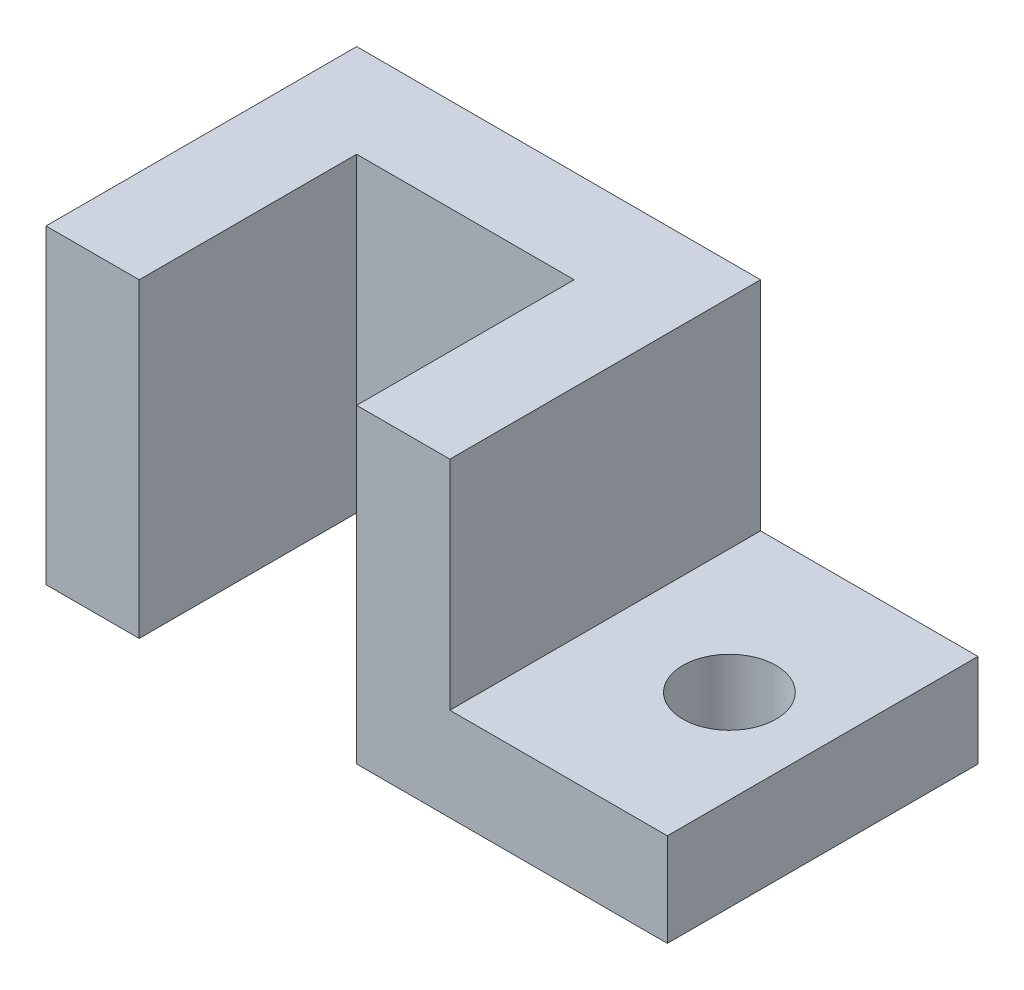
ISO-10303-21;
HEADER;
FILE_DESCRIPTION(('STEP AP214'),'2;1');
FILE_NAME('part.step','',(''),(''),'','','');
FILE_SCHEMA(('AUTOMOTIVE_DESIGN { 1 0 10303 214 1 1 1 1 }'));
ENDSEC;
DATA;
#1=APPLICATION_CONTEXT('core data for automotive mechanical design processes');
#2=APPLICATION_PROTOCOL_DEFINITION('international standard','automotive_design',2000,#1);
#3=PRODUCT_CONTEXT('',#1,'mechanical');
#4=PRODUCT('Part','Part','',(#3));
#5=PRODUCT_RELATED_PRODUCT_CATEGORY('part','',(#4));
#6=PRODUCT_DEFINITION_FORMATION('','',#4);
#7=PRODUCT_DEFINITION_CONTEXT('part definition',#1,'design');
#8=PRODUCT_DEFINITION('design','',#6,#7);
#9=PRODUCT_DEFINITION_SHAPE('','',#8);
#10=(LENGTH_UNIT() NAMED_UNIT(*) SI_UNIT(.MILLI.,.METRE.));
#11=(NAMED_UNIT(*) PLANE_ANGLE_UNIT() SI_UNIT($,.RADIAN.));
#12=(NAMED_UNIT(*) SI_UNIT($,.STERADIAN.) SOLID_ANGLE_UNIT());
#13=UNCERTAINTY_MEASURE_WITH_UNIT(LENGTH_MEASURE(1.E-05),#10,'distance_accuracy_value','');
#14=(GEOMETRIC_REPRESENTATION_CONTEXT(3) GLOBAL_UNCERTAINTY_ASSIGNED_CONTEXT((#13)) GLOBAL_UNIT_ASSIGNED_CONTEXT((#10,
#11,#12)) REPRESENTATION_CONTEXT('',''));
#15=CARTESIAN_POINT('',(0.,0.,0.));
#16=DIRECTION('',(0.,0.,1.));
#17=DIRECTION('',(1.,0.,0.));
#18=AXIS2_PLACEMENT_3D('',#15,#16,#17);
#19=CARTESIAN_POINT('',(0.,63.5,63.5));
#20=DIRECTION('',(1.,0.,0.));
#21=DIRECTION('',(0.,1.,0.));
#22=AXIS2_PLACEMENT_3D('',#19,#20,#21);
#23=PLANE('',#22);
#24=DIRECTION('',(0.,1.,0.));
#25=VECTOR('',#24,1.);
#26=CARTESIAN_POINT('',(0.,0.,19.05));
#27=LINE('',#26,#25);
#28=CARTESIAN_POINT('',(0.,0.,19.05));
#29=VERTEX_POINT('',#28);
#30=CARTESIAN_POINT('',(0.,63.5,19.05));
#31=VERTEX_POINT('',#30);
#32=EDGE_CURVE('E51',#29,#31,#27,.T.);
#33=ORIENTED_EDGE('',*,*,#32,.F.);
#34=DIRECTION('',(0.,0.,-1.));
#35=VECTOR('',#34,1.);
#36=CARTESIAN_POINT('',(0.,0.,63.5));
#37=LINE('',#36,#35);
#38=CARTESIAN_POINT('',(0.,0.,63.5));
#39=VERTEX_POINT('',#38);
#40=EDGE_CURVE('E108',#39,#29,#37,.T.);
#41=ORIENTED_EDGE('',*,*,#40,.F.);
#42=DIRECTION('',(0.,-1.,0.));
#43=VECTOR('',#42,1.);
#44=CARTESIAN_POINT('',(0.,63.5,63.5));
#45=LINE('',#44,#43);
#46=CARTESIAN_POINT('',(0.,63.5,63.5));
#47=VERTEX_POINT('',#46);
#48=EDGE_CURVE('E99',#47,#39,#45,.T.);
#49=ORIENTED_EDGE('',*,*,#48,.F.);
#50=DIRECTION('',(0.,0.,-1.));
#51=VECTOR('',#50,1.);
#52=CARTESIAN_POINT('',(0.,63.5,63.5));
#53=LINE('',#52,#51);
#54=EDGE_CURVE('E112',#47,#31,#53,.T.);
#55=ORIENTED_EDGE('',*,*,#54,.T.);
#56=EDGE_LOOP('',(#33,#41,#49,#55));
#57=FACE_BOUND('',#56,.T.);
#58=ADVANCED_FACE('F36',(#57),#23,.F.);
#59=CARTESIAN_POINT('',(63.5,19.05,63.5));
#60=DIRECTION('',(0.,-1.,0.));
#61=DIRECTION('',(1.,0.,0.));
#62=AXIS2_PLACEMENT_3D('',#59,#60,#61);
#63=PLANE('',#62);
#64=CARTESIAN_POINT('',(44.4409307718662,19.05,31.75));
#65=DIRECTION('',(0.,1.,0.));
#66=DIRECTION('',(-1.,0.,0.));
#67=AXIS2_PLACEMENT_3D('',#64,#65,#66);
#68=CIRCLE('',#67,9.525);
#69=CARTESIAN_POINT('',(34.9159307718662,19.05,31.75));
#70=VERTEX_POINT('',#69);
#71=EDGE_CURVE('E170',#70,#70,#68,.T.);
#72=ORIENTED_EDGE('',*,*,#71,.F.);
#73=EDGE_LOOP('',(#72));
#74=FACE_BOUND('',#73,.T.);
#75=DIRECTION('',(-1.,0.,0.));
#76=VECTOR('',#75,1.);
#77=CARTESIAN_POINT('',(63.5,19.05,0.));
#78=LINE('',#77,#76);
#79=CARTESIAN_POINT('',(63.5,19.05,0.));
#80=VERTEX_POINT('',#79);
#81=CARTESIAN_POINT('',(19.05,19.05,0.));
#82=VERTEX_POINT('',#81);
#83=EDGE_CURVE('E121',#80,#82,#78,.T.);
#84=ORIENTED_EDGE('',*,*,#83,.T.);
#85=DIRECTION('',(0.,0.,-1.));
#86=VECTOR('',#85,1.);
#87=CARTESIAN_POINT('',(19.05,19.05,63.5));
#88=LINE('',#87,#86);
#89=CARTESIAN_POINT('',(19.05,19.05,63.5));
#90=VERTEX_POINT('',#89);
#91=EDGE_CURVE('E11',#90,#82,#88,.T.);
#92=ORIENTED_EDGE('',*,*,#91,.F.);
#93=DIRECTION('',(-1.,0.,0.));
#94=VECTOR('',#93,1.);
#95=CARTESIAN_POINT('',(63.5,19.05,63.5));
#96=LINE('',#95,#94);
#97=CARTESIAN_POINT('',(63.5,19.05,63.5));
#98=VERTEX_POINT('',#97);
#99=EDGE_CURVE('E132',#98,#90,#96,.T.);
#100=ORIENTED_EDGE('',*,*,#99,.F.);
#101=DIRECTION('',(0.,0.,-1.));
#102=VECTOR('',#101,1.);
#103=CARTESIAN_POINT('',(63.5,19.05,63.5));
#104=LINE('',#103,#102);
#105=EDGE_CURVE('E117',#98,#80,#104,.T.);
#106=ORIENTED_EDGE('',*,*,#105,.T.);
#107=EDGE_LOOP('',(#84,#92,#100,#106));
#108=FACE_BOUND('',#107,.T.);
#109=ADVANCED_FACE('F38',(#74,#108),#63,.F.);
#110=CARTESIAN_POINT('',(19.05,19.05,63.5));
#111=DIRECTION('',(-1.,0.,0.));
#112=DIRECTION('',(0.,-1.,0.));
#113=AXIS2_PLACEMENT_3D('',#110,#111,#112);
#114=PLANE('',#113);
#115=DIRECTION('',(0.,1.,0.));
#116=VECTOR('',#115,1.);
#117=CARTESIAN_POINT('',(19.05,19.05,0.));
#118=LINE('',#117,#116);
#119=CARTESIAN_POINT('',(19.05,63.5,0.));
#120=VERTEX_POINT('',#119);
#121=EDGE_CURVE('E124',#82,#120,#118,.T.);
#122=ORIENTED_EDGE('',*,*,#121,.T.);
#123=DIRECTION('',(0.,0.,-1.));
#124=VECTOR('',#123,1.);
#125=CARTESIAN_POINT('',(19.05,63.5,63.5));
#126=LINE('',#125,#124);
#127=CARTESIAN_POINT('',(19.05,63.5,63.5));
#128=VERTEX_POINT('',#127);
#129=EDGE_CURVE('E44',#128,#120,#126,.T.);
#130=ORIENTED_EDGE('',*,*,#129,.F.);
#131=DIRECTION('',(0.,1.,0.));
#132=VECTOR('',#131,1.);
#133=CARTESIAN_POINT('',(19.05,19.05,63.5));
#134=LINE('',#133,#132);
#135=EDGE_CURVE('E89',#90,#128,#134,.T.);
#136=ORIENTED_EDGE('',*,*,#135,.F.);
#137=ORIENTED_EDGE('',*,*,#91,.T.);
#138=EDGE_LOOP('',(#122,#130,#136,#137));
#139=FACE_BOUND('',#138,.T.);
#140=ADVANCED_FACE('F193',(#139),#114,.F.);
#141=CARTESIAN_POINT('',(19.05,63.5,63.5));
#142=DIRECTION('',(0.,-1.,0.));
#143=DIRECTION('',(1.,0.,0.));
#144=AXIS2_PLACEMENT_3D('',#141,#142,#143);
#145=PLANE('',#144);
#146=DIRECTION('',(-1.,0.,0.));
#147=VECTOR('',#146,1.);
#148=CARTESIAN_POINT('',(19.05,63.5,0.));
#149=LINE('',#148,#147);
#150=CARTESIAN_POINT('',(-63.5,63.5,0.));
#151=VERTEX_POINT('',#150);
#152=EDGE_CURVE('E126',#120,#151,#149,.T.);
#153=ORIENTED_EDGE('',*,*,#152,.T.);
#154=DIRECTION('',(0.,0.,1.));
#155=VECTOR('',#154,1.);
#156=CARTESIAN_POINT('',(-63.5,63.5,0.));
#157=LINE('',#156,#155);
#158=CARTESIAN_POINT('',(-63.5,63.5,63.5));
#159=VERTEX_POINT('',#158);
#160=EDGE_CURVE('E159',#151,#159,#157,.T.);
#161=ORIENTED_EDGE('',*,*,#160,.T.);
#162=DIRECTION('',(1.,0.,0.));
#163=VECTOR('',#162,1.);
#164=CARTESIAN_POINT('',(-63.5,63.5,63.5));
#165=LINE('',#164,#163);
#166=CARTESIAN_POINT('',(-44.45,63.5,63.5));
#167=VERTEX_POINT('',#166);
#168=EDGE_CURVE('E164',#159,#167,#165,.T.);
#169=ORIENTED_EDGE('',*,*,#168,.T.);
#170=DIRECTION('',(0.,0.,-1.));
#171=VECTOR('',#170,1.);
#172=CARTESIAN_POINT('',(-44.45,63.5,63.5));
#173=LINE('',#172,#171);
#174=CARTESIAN_POINT('',(-44.45,63.5,19.05));
#175=VERTEX_POINT('',#174);
#176=EDGE_CURVE('E167',#167,#175,#173,.T.);
#177=ORIENTED_EDGE('',*,*,#176,.T.);
#178=DIRECTION('',(1.,0.,0.));
#179=VECTOR('',#178,1.);
#180=CARTESIAN_POINT('',(-44.45,63.5,19.05));
#181=LINE('',#180,#179);
#182=EDGE_CURVE('E177',#175,#31,#181,.T.);
#183=ORIENTED_EDGE('',*,*,#182,.T.);
#184=ORIENTED_EDGE('',*,*,#54,.F.);
#185=DIRECTION('',(-1.,0.,0.));
#186=VECTOR('',#185,1.);
#187=CARTESIAN_POINT('',(19.05,63.5,63.5));
#188=LINE('',#187,#186);
#189=EDGE_CURVE('E105',#128,#47,#188,.T.);
#190=ORIENTED_EDGE('',*,*,#189,.F.);
#191=ORIENTED_EDGE('',*,*,#129,.T.);
#192=EDGE_LOOP('',(#153,#161,#169,#177,#183,#184,#190,#191));
#193=FACE_BOUND('',#192,.T.);
#194=ADVANCED_FACE('F138',(#193),#145,.F.);
#195=CARTESIAN_POINT('',(0.,0.,63.5));
#196=DIRECTION('',(0.,1.,0.));
#197=DIRECTION('',(0.,0.,1.));
#198=AXIS2_PLACEMENT_3D('',#195,#196,#197);
#199=PLANE('',#198);
#200=CARTESIAN_POINT('',(44.4409307718662,0.,31.75));
#201=DIRECTION('',(0.,1.,0.));
#202=DIRECTION('',(-1.,0.,0.));
#203=AXIS2_PLACEMENT_3D('',#200,#201,#202);
#204=CIRCLE('',#203,9.525);
#205=CARTESIAN_POINT('',(34.9159307718662,0.,31.75));
#206=VERTEX_POINT('',#205);
#207=EDGE_CURVE('E165',#206,#206,#204,.T.);
#208=ORIENTED_EDGE('',*,*,#207,.T.);
#209=EDGE_LOOP('',(#208));
#210=FACE_BOUND('',#209,.T.);
#211=DIRECTION('',(1.,0.,0.));
#212=VECTOR('',#211,1.);
#213=CARTESIAN_POINT('',(0.,0.,0.));
#214=LINE('',#213,#212);
#215=CARTESIAN_POINT('',(-63.5,0.,0.));
#216=VERTEX_POINT('',#215);
#217=CARTESIAN_POINT('',(63.5,0.,0.));
#218=VERTEX_POINT('',#217);
#219=EDGE_CURVE('E129',#216,#218,#214,.T.);
#220=ORIENTED_EDGE('',*,*,#219,.T.);
#221=DIRECTION('',(0.,0.,-1.));
#222=VECTOR('',#221,1.);
#223=CARTESIAN_POINT('',(63.5,0.,63.5));
#224=LINE('',#223,#222);
#225=CARTESIAN_POINT('',(63.5,0.,63.5));
#226=VERTEX_POINT('',#225);
#227=EDGE_CURVE('E113',#226,#218,#224,.T.);
#228=ORIENTED_EDGE('',*,*,#227,.F.);
#229=DIRECTION('',(1.,0.,0.));
#230=VECTOR('',#229,1.);
#231=CARTESIAN_POINT('',(0.,0.,63.5));
#232=LINE('',#231,#230);
#233=EDGE_CURVE('E102',#39,#226,#232,.T.);
#234=ORIENTED_EDGE('',*,*,#233,.F.);
#235=ORIENTED_EDGE('',*,*,#40,.T.);
#236=DIRECTION('',(1.,0.,0.));
#237=VECTOR('',#236,1.);
#238=CARTESIAN_POINT('',(-44.4499999999999,0.,19.05));
#239=LINE('',#238,#237);
#240=CARTESIAN_POINT('',(-44.4499999999999,0.,19.05));
#241=VERTEX_POINT('',#240);
#242=EDGE_CURVE('E156',#241,#29,#239,.T.);
#243=ORIENTED_EDGE('',*,*,#242,.F.);
#244=DIRECTION('',(0.,0.,-1.));
#245=VECTOR('',#244,1.);
#246=CARTESIAN_POINT('',(-44.4499999999999,0.,63.5));
#247=LINE('',#246,#245);
#248=CARTESIAN_POINT('',(-44.4499999999999,0.,63.5));
#249=VERTEX_POINT('',#248);
#250=EDGE_CURVE('E244',#249,#241,#247,.T.);
#251=ORIENTED_EDGE('',*,*,#250,.F.);
#252=DIRECTION('',(1.,0.,0.));
#253=VECTOR('',#252,1.);
#254=CARTESIAN_POINT('',(-63.4999999999999,0.,63.5));
#255=LINE('',#254,#253);
#256=CARTESIAN_POINT('',(-63.4999999999999,0.,63.5));
#257=VERTEX_POINT('',#256);
#258=EDGE_CURVE('E242',#257,#249,#255,.T.);
#259=ORIENTED_EDGE('',*,*,#258,.F.);
#260=DIRECTION('',(0.,0.,1.));
#261=VECTOR('',#260,1.);
#262=CARTESIAN_POINT('',(-63.5,0.,0.));
#263=LINE('',#262,#261);
#264=EDGE_CURVE('E180',#216,#257,#263,.T.);
#265=ORIENTED_EDGE('',*,*,#264,.F.);
#266=EDGE_LOOP('',(#220,#228,#234,#235,#243,#251,#259,#265));
#267=FACE_BOUND('',#266,.T.);
#268=ADVANCED_FACE('F115',(#210,#267),#199,.F.);
#269=CARTESIAN_POINT('',(63.5,0.,63.5));
#270=DIRECTION('',(-1.,0.,0.));
#271=DIRECTION('',(0.,0.,1.));
#272=AXIS2_PLACEMENT_3D('',#269,#270,#271);
#273=PLANE('',#272);
#274=DIRECTION('',(0.,1.,0.));
#275=VECTOR('',#274,1.);
#276=CARTESIAN_POINT('',(63.5,0.,0.));
#277=LINE('',#276,#275);
#278=EDGE_CURVE('E81',#218,#80,#277,.T.);
#279=ORIENTED_EDGE('',*,*,#278,.T.);
#280=ORIENTED_EDGE('',*,*,#105,.F.);
#281=DIRECTION('',(0.,1.,0.));
#282=VECTOR('',#281,1.);
#283=CARTESIAN_POINT('',(63.5,0.,63.5));
#284=LINE('',#283,#282);
#285=EDGE_CURVE('E60',#226,#98,#284,.T.);
#286=ORIENTED_EDGE('',*,*,#285,.F.);
#287=ORIENTED_EDGE('',*,*,#227,.T.);
#288=EDGE_LOOP('',(#279,#280,#286,#287));
#289=FACE_BOUND('',#288,.T.);
#290=ADVANCED_FACE('F208',(#289),#273,.F.);
#291=CARTESIAN_POINT('',(0.,0.,63.5));
#292=DIRECTION('',(0.,0.,-1.));
#293=DIRECTION('',(-1.,0.,0.));
#294=AXIS2_PLACEMENT_3D('',#291,#292,#293);
#295=PLANE('',#294);
#296=ORIENTED_EDGE('',*,*,#99,.T.);
#297=ORIENTED_EDGE('',*,*,#135,.T.);
#298=ORIENTED_EDGE('',*,*,#189,.T.);
#299=ORIENTED_EDGE('',*,*,#48,.T.);
#300=ORIENTED_EDGE('',*,*,#233,.T.);
#301=ORIENTED_EDGE('',*,*,#285,.T.);
#302=EDGE_LOOP('',(#296,#297,#298,#299,#300,#301));
#303=FACE_BOUND('',#302,.T.);
#304=ADVANCED_FACE('F100',(#303),#295,.F.);
#305=CARTESIAN_POINT('',(0.,0.,0.));
#306=DIRECTION('',(0.,0.,-1.));
#307=DIRECTION('',(-1.,0.,0.));
#308=AXIS2_PLACEMENT_3D('',#305,#306,#307);
#309=PLANE('',#308);
#310=ORIENTED_EDGE('',*,*,#83,.F.);
#311=ORIENTED_EDGE('',*,*,#278,.F.);
#312=ORIENTED_EDGE('',*,*,#219,.F.);
#313=DIRECTION('',(0.,1.,0.));
#314=VECTOR('',#313,1.);
#315=CARTESIAN_POINT('',(-63.5,0.,0.));
#316=LINE('',#315,#314);
#317=EDGE_CURVE('E147',#216,#151,#316,.T.);
#318=ORIENTED_EDGE('',*,*,#317,.T.);
#319=ORIENTED_EDGE('',*,*,#152,.F.);
#320=ORIENTED_EDGE('',*,*,#121,.F.);
#321=EDGE_LOOP('',(#310,#311,#312,#318,#319,#320));
#322=FACE_BOUND('',#321,.T.);
#323=ADVANCED_FACE('F144',(#322),#309,.T.);
#324=CARTESIAN_POINT('',(-44.4499999999999,0.,19.05));
#325=DIRECTION('',(0.,0.,1.));
#326=DIRECTION('',(1.,0.,0.));
#327=AXIS2_PLACEMENT_3D('',#324,#325,#326);
#328=PLANE('',#327);
#329=ORIENTED_EDGE('',*,*,#182,.F.);
#330=DIRECTION('',(0.,1.,0.));
#331=VECTOR('',#330,1.);
#332=CARTESIAN_POINT('',(-44.4499999999999,0.,19.05));
#333=LINE('',#332,#331);
#334=EDGE_CURVE('E182',#241,#175,#333,.T.);
#335=ORIENTED_EDGE('',*,*,#334,.F.);
#336=ORIENTED_EDGE('',*,*,#242,.T.);
#337=ORIENTED_EDGE('',*,*,#32,.T.);
#338=EDGE_LOOP('',(#329,#335,#336,#337));
#339=FACE_BOUND('',#338,.T.);
#340=ADVANCED_FACE('F214',(#339),#328,.T.);
#341=CARTESIAN_POINT('',(-44.4499999999999,0.,63.5));
#342=DIRECTION('',(1.,0.,0.));
#343=DIRECTION('',(0.,1.,0.));
#344=AXIS2_PLACEMENT_3D('',#341,#342,#343);
#345=PLANE('',#344);
#346=ORIENTED_EDGE('',*,*,#176,.F.);
#347=DIRECTION('',(0.,1.,0.));
#348=VECTOR('',#347,1.);
#349=CARTESIAN_POINT('',(-44.4499999999999,0.,63.5));
#350=LINE('',#349,#348);
#351=EDGE_CURVE('E185',#249,#167,#350,.T.);
#352=ORIENTED_EDGE('',*,*,#351,.F.);
#353=ORIENTED_EDGE('',*,*,#250,.T.);
#354=ORIENTED_EDGE('',*,*,#334,.T.);
#355=EDGE_LOOP('',(#346,#352,#353,#354));
#356=FACE_BOUND('',#355,.T.);
#357=ADVANCED_FACE('F223',(#356),#345,.T.);
#358=CARTESIAN_POINT('',(-63.4999999999999,0.,63.5));
#359=DIRECTION('',(0.,0.,1.));
#360=DIRECTION('',(1.,0.,0.));
#361=AXIS2_PLACEMENT_3D('',#358,#359,#360);
#362=PLANE('',#361);
#363=ORIENTED_EDGE('',*,*,#168,.F.);
#364=DIRECTION('',(0.,1.,0.));
#365=VECTOR('',#364,1.);
#366=CARTESIAN_POINT('',(-63.4999999999999,0.,63.5));
#367=LINE('',#366,#365);
#368=EDGE_CURVE('E155',#257,#159,#367,.T.);
#369=ORIENTED_EDGE('',*,*,#368,.F.);
#370=ORIENTED_EDGE('',*,*,#258,.T.);
#371=ORIENTED_EDGE('',*,*,#351,.T.);
#372=EDGE_LOOP('',(#363,#369,#370,#371));
#373=FACE_BOUND('',#372,.T.);
#374=ADVANCED_FACE('F220',(#373),#362,.T.);
#375=CARTESIAN_POINT('',(-63.5,0.,0.));
#376=DIRECTION('',(-1.,0.,0.));
#377=DIRECTION('',(0.,-1.,0.));
#378=AXIS2_PLACEMENT_3D('',#375,#376,#377);
#379=PLANE('',#378);
#380=ORIENTED_EDGE('',*,*,#160,.F.);
#381=ORIENTED_EDGE('',*,*,#317,.F.);
#382=ORIENTED_EDGE('',*,*,#264,.T.);
#383=ORIENTED_EDGE('',*,*,#368,.T.);
#384=EDGE_LOOP('',(#380,#381,#382,#383));
#385=FACE_BOUND('',#384,.T.);
#386=ADVANCED_FACE('F160',(#385),#379,.T.);
#387=CARTESIAN_POINT('',(44.4409307718662,0.,31.75));
#388=DIRECTION('',(0.,1.,0.));
#389=DIRECTION('',(-1.,0.,0.));
#390=AXIS2_PLACEMENT_3D('',#387,#388,#389);
#391=CYLINDRICAL_SURFACE('',#390,9.525);
#392=ORIENTED_EDGE('',*,*,#207,.F.);
#393=EDGE_LOOP('',(#392));
#394=FACE_BOUND('',#393,.T.);
#395=ORIENTED_EDGE('',*,*,#71,.T.);
#396=EDGE_LOOP('',(#395));
#397=FACE_BOUND('',#396,.T.);
#398=ADVANCED_FACE('F219',(#394,#397),#391,.F.);
#399=CLOSED_SHELL('',(#58,#109,#140,#194,#268,#290,#304,#323,#340,#357,#374,#386,#398));
#400=MANIFOLD_SOLID_BREP('B2',#399);
#401=ADVANCED_BREP_SHAPE_REPRESENTATION('',(#18,#400),#14);
#402=SHAPE_DEFINITION_REPRESENTATION(#9,#401);
ENDSEC;
END-ISO-10303-21;
